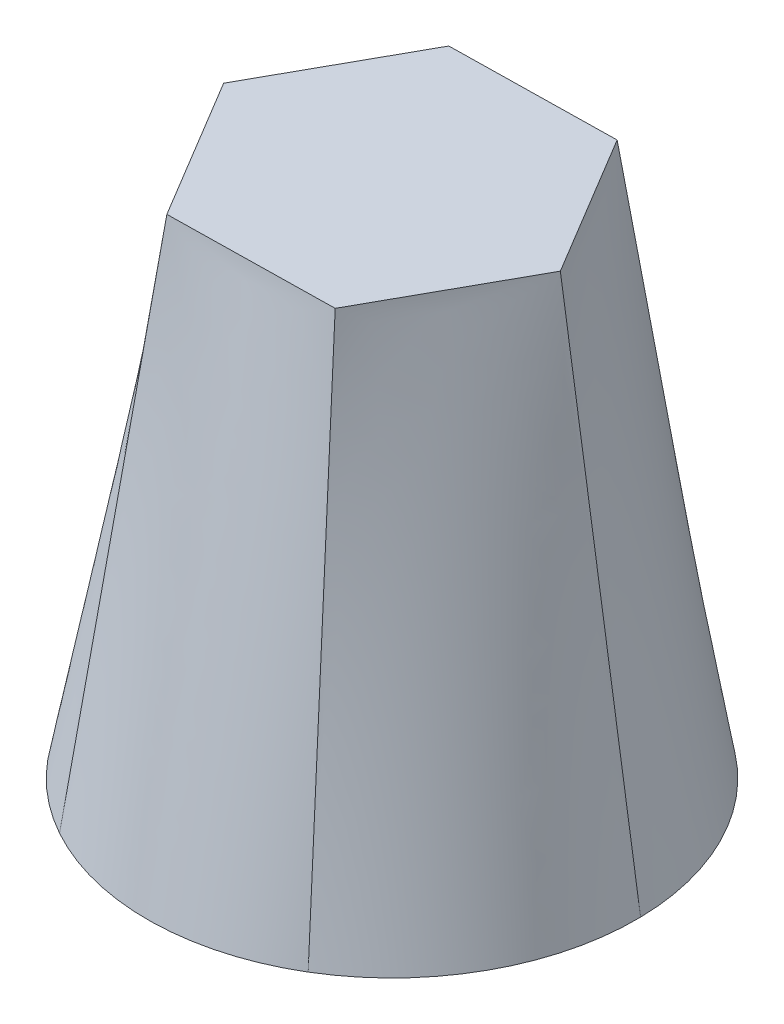
ISO-10303-21;
HEADER;
FILE_DESCRIPTION(('STEP AP214'),'2;1');
FILE_NAME('part.step','',(''),(''),'','','');
FILE_SCHEMA(('AUTOMOTIVE_DESIGN { 1 0 10303 214 1 1 1 1 }'));
ENDSEC;
DATA;
#1=APPLICATION_CONTEXT('core data for automotive mechanical design processes');
#2=APPLICATION_PROTOCOL_DEFINITION('international standard','automotive_design',2000,#1);
#3=PRODUCT_CONTEXT('',#1,'mechanical');
#4=PRODUCT('Part','Part','',(#3));
#5=PRODUCT_RELATED_PRODUCT_CATEGORY('part','',(#4));
#6=PRODUCT_DEFINITION_FORMATION('','',#4);
#7=PRODUCT_DEFINITION_CONTEXT('part definition',#1,'design');
#8=PRODUCT_DEFINITION('design','',#6,#7);
#9=PRODUCT_DEFINITION_SHAPE('','',#8);
#10=(LENGTH_UNIT() NAMED_UNIT(*) SI_UNIT(.MILLI.,.METRE.));
#11=(NAMED_UNIT(*) PLANE_ANGLE_UNIT() SI_UNIT($,.RADIAN.));
#12=(NAMED_UNIT(*) SI_UNIT($,.STERADIAN.) SOLID_ANGLE_UNIT());
#13=UNCERTAINTY_MEASURE_WITH_UNIT(LENGTH_MEASURE(1.E-05),#10,'distance_accuracy_value','');
#14=(GEOMETRIC_REPRESENTATION_CONTEXT(3) GLOBAL_UNCERTAINTY_ASSIGNED_CONTEXT((#13)) GLOBAL_UNIT_ASSIGNED_CONTEXT((#10,
#11,#12)) REPRESENTATION_CONTEXT('',''));
#15=CARTESIAN_POINT('',(0.,0.,0.));
#16=DIRECTION('',(0.,0.,1.));
#17=DIRECTION('',(1.,0.,0.));
#18=AXIS2_PLACEMENT_3D('',#15,#16,#17);
#19=CARTESIAN_POINT('',(0.,0.,0.));
#20=DIRECTION('',(0.,1.,0.));
#21=DIRECTION('',(0.,0.,1.));
#22=AXIS2_PLACEMENT_3D('',#19,#20,#21);
#23=PLANE('',#22);
#24=CARTESIAN_POINT('',(0.,0.,0.));
#25=DIRECTION('',(0.,1.,0.));
#26=DIRECTION('',(0.,0.,1.));
#27=AXIS2_PLACEMENT_3D('',#24,#25,#26);
#28=CIRCLE('',#27,65.740135956893);
#29=CARTESIAN_POINT('',(-65.7308360250275,0.,1.10574458249409));
#30=VERTEX_POINT('',#29);
#31=CARTESIAN_POINT('',(-31.9078151139768,0.,57.4774461009102));
#32=VERTEX_POINT('',#31);
#33=EDGE_CURVE('E12',#30,#32,#28,.T.);
#34=ORIENTED_EDGE('',*,*,#33,.F.);
#35=CARTESIAN_POINT('',(-33.8230209110506,0.,-56.3717015184162));
#36=VERTEX_POINT('',#35);
#37=EDGE_CURVE('E146',#36,#30,#28,.T.);
#38=ORIENTED_EDGE('',*,*,#37,.F.);
#39=CARTESIAN_POINT('',(31.9078151139768,0.,-57.4774461009102));
#40=VERTEX_POINT('',#39);
#41=EDGE_CURVE('E330',#40,#36,#28,.T.);
#42=ORIENTED_EDGE('',*,*,#41,.F.);
#43=CARTESIAN_POINT('',(65.7308360250275,0.,-1.10574458249416));
#44=VERTEX_POINT('',#43);
#45=EDGE_CURVE('E326',#44,#40,#28,.T.);
#46=ORIENTED_EDGE('',*,*,#45,.F.);
#47=CARTESIAN_POINT('',(33.8230209110507,0.,56.3717015184161));
#48=VERTEX_POINT('',#47);
#49=EDGE_CURVE('E247',#48,#44,#28,.T.);
#50=ORIENTED_EDGE('',*,*,#49,.F.);
#51=EDGE_CURVE('E92',#32,#48,#28,.T.);
#52=ORIENTED_EDGE('',*,*,#51,.F.);
#53=EDGE_LOOP('',(#34,#38,#42,#46,#50,#52));
#54=FACE_BOUND('',#53,.T.);
#55=ADVANCED_FACE('F81',(#54),#23,.F.);
#56=CARTESIAN_POINT('',(0.,140.,0.));
#57=DIRECTION('',(0.,1.,0.));
#58=DIRECTION('',(0.,0.,1.));
#59=AXIS2_PLACEMENT_3D('',#56,#57,#58);
#60=PLANE('',#59);
#61=DIRECTION('',(0.999858534946269,0.,-0.0168199314832446));
#62=VECTOR('',#61,1.);
#63=CARTESIAN_POINT('',(-21.6097773689527,140.,38.9269779061924));
#64=LINE('',#63,#62);
#65=CARTESIAN_POINT('',(-21.6097773689527,140.,38.9269779061924));
#66=VERTEX_POINT('',#65);
#67=CARTESIAN_POINT('',(22.9068630748419,140.,38.1781051247353));
#68=VERTEX_POINT('',#67);
#69=EDGE_CURVE('E224',#66,#68,#64,.T.);
#70=ORIENTED_EDGE('',*,*,#69,.T.);
#71=DIRECTION('',(0.485362779518731,0.,-0.874312857195782));
#72=VECTOR('',#71,1.);
#73=CARTESIAN_POINT('',(22.9068630748419,140.,38.1781051247353));
#74=LINE('',#73,#72);
#75=CARTESIAN_POINT('',(44.5166404437946,140.,-0.74887278145714));
#76=VERTEX_POINT('',#75);
#77=EDGE_CURVE('E215',#68,#76,#74,.T.);
#78=ORIENTED_EDGE('',*,*,#77,.T.);
#79=DIRECTION('',(-0.514495755427538,0.,-0.857492925712537));
#80=VECTOR('',#79,1.);
#81=CARTESIAN_POINT('',(44.5166404437946,140.,-0.74887278145714));
#82=LINE('',#81,#80);
#83=CARTESIAN_POINT('',(21.6097773689527,140.,-38.9269779061924));
#84=VERTEX_POINT('',#83);
#85=EDGE_CURVE('E223',#76,#84,#82,.T.);
#86=ORIENTED_EDGE('',*,*,#85,.T.);
#87=DIRECTION('',(-0.999858534946269,0.,0.0168199314832446));
#88=VECTOR('',#87,1.);
#89=CARTESIAN_POINT('',(21.6097773689527,140.,-38.9269779061924));
#90=LINE('',#89,#88);
#91=CARTESIAN_POINT('',(-22.9068630748419,140.,-38.1781051247353));
#92=VERTEX_POINT('',#91);
#93=EDGE_CURVE('E165',#84,#92,#90,.T.);
#94=ORIENTED_EDGE('',*,*,#93,.T.);
#95=DIRECTION('',(-0.485362779518731,0.,0.874312857195782));
#96=VECTOR('',#95,1.);
#97=CARTESIAN_POINT('',(-22.9068630748419,140.,-38.1781051247353));
#98=LINE('',#97,#96);
#99=CARTESIAN_POINT('',(-44.5166404437946,140.,0.748872781457122));
#100=VERTEX_POINT('',#99);
#101=EDGE_CURVE('E143',#92,#100,#98,.T.);
#102=ORIENTED_EDGE('',*,*,#101,.T.);
#103=DIRECTION('',(0.514495755427538,0.,0.857492925712538));
#104=VECTOR('',#103,1.);
#105=CARTESIAN_POINT('',(-44.5166404437946,140.,0.748872781457122));
#106=LINE('',#105,#104);
#107=EDGE_CURVE('E151',#100,#66,#106,.T.);
#108=ORIENTED_EDGE('',*,*,#107,.T.);
#109=EDGE_LOOP('',(#70,#78,#86,#94,#102,#108));
#110=FACE_BOUND('',#109,.T.);
#111=ADVANCED_FACE('F163',(#110),#60,.T.);
#112=CARTESIAN_POINT('',(-44.5166404437946,140.,0.748872781457133));
#113=CARTESIAN_POINT('',(-65.7308360250275,0.,1.10574458249409));
#114=CARTESIAN_POINT('',(-43.6162330534215,140.,-0.87308463130089));
#115=CARTESIAN_POINT('',(-65.7769087159648,0.,-1.63304025188206));
#116=CARTESIAN_POINT('',(-42.7158256630485,140.,-2.49504204405891));
#117=CARTESIAN_POINT('',(-65.6519822431778,0.,-4.42104843356951));
#118=CARTESIAN_POINT('',(-40.9150108823024,140.,-5.73895686957495));
#119=CARTESIAN_POINT('',(-65.0316502511347,0.,-10.0305985526583));
#120=CARTESIAN_POINT('',(-40.0146034919294,140.,-7.36091428233297));
#121=CARTESIAN_POINT('',(-64.5361137708421,0.,-12.8519784839461));
#122=CARTESIAN_POINT('',(-38.2137887111833,140.,-10.604829107849));
#123=CARTESIAN_POINT('',(-63.1626871824775,0.,-18.454221183333));
#124=CARTESIAN_POINT('',(-37.3133813208103,140.,-12.226786520607));
#125=CARTESIAN_POINT('',(-62.2847335134089,0.,-21.2348709548059));
#126=CARTESIAN_POINT('',(-35.5125665400643,140.,-15.4707013461231));
#127=CARTESIAN_POINT('',(-60.1545734397769,0.,-26.6783632852936));
#128=CARTESIAN_POINT('',(-34.6121591496912,140.,-17.0926587588811));
#129=CARTESIAN_POINT('',(-58.9023916495822,0.,-29.3409759030198));
#130=CARTESIAN_POINT('',(-32.8113443689452,140.,-20.3365735843971));
#131=CARTESIAN_POINT('',(-56.0525005522383,0.,-34.4746543249339));
#132=CARTESIAN_POINT('',(-31.9109369785721,140.,-21.9585309971552));
#133=CARTESIAN_POINT('',(-54.4549049918939,0.,-36.9455152302336));
#134=CARTESIAN_POINT('',(-30.1101221978261,140.,-25.2024458226712));
#135=CARTESIAN_POINT('',(-50.9614424711375,0.,-41.6321889235308));
#136=CARTESIAN_POINT('',(-29.2097148074531,140.,-26.8244032354292));
#137=CARTESIAN_POINT('',(-49.0657576487895,0.,-43.8478592173568));
#138=CARTESIAN_POINT('',(-27.408900026707,140.,-30.0683180609452));
#139=CARTESIAN_POINT('',(-45.0373654235432,0.,-47.9762341925784));
#140=CARTESIAN_POINT('',(-26.508492636334,140.,-31.6902754737032));
#141=CARTESIAN_POINT('',(-42.9048724086561,0.,-49.8888801769236));
#142=CARTESIAN_POINT('',(-24.7076778555879,140.,-34.9341902992193));
#143=CARTESIAN_POINT('',(-38.4720072228645,0.,-53.3819548345165));
#144=CARTESIAN_POINT('',(-23.8072704652149,140.,-36.5561477119773));
#145=CARTESIAN_POINT('',(-36.1718418076513,0.,-54.9624089804557));
#146=CARTESIAN_POINT('',(-22.9068630748419,140.,-38.1781051247353));
#147=CARTESIAN_POINT('',(-33.8230209110506,0.,-56.3717015184162));
#148=B_SPLINE_SURFACE_WITH_KNOTS('',3,1,((#112,#113),(#114,#115),(#116,#117),(#118,#119),(#120,
#121),(#122,#123),(#124,#125),(#126,#127),(#128,#129),(#130,#131),(#132,#133),(#134,#135),(#136,
#137),(#138,#139),(#140,#141),(#142,#143),(#144,#145),(#146,#147)),.UNSPECIFIED.,.F.,.F.,.F.,(4,
2,2,2,2,2,2,2,4),(2,2),(0.,0.125,0.25,0.375,0.5,0.625,0.75,0.875,1.),(0.,1.),.UNSPECIFIED.);
#149=DIRECTION('',(-0.0770922609547298,-0.988710194154777,-0.128487101591213));
#150=VECTOR('',#149,1.);
#151=CARTESIAN_POINT('',(-28.3649419929462,70.,-47.2749033215757));
#152=LINE('',#151,#150);
#153=EDGE_CURVE('E150',#92,#36,#152,.T.);
#154=DIRECTION('',(0.149819224513988,0.988710194154777,-0.00252030562636869));
#155=VECTOR('',#154,1.);
#156=CARTESIAN_POINT('',(-55.123738234411,70.,0.927308681975612));
#157=LINE('',#156,#155);
#158=EDGE_CURVE('E138',#30,#100,#157,.T.);
#159=ORIENTED_EDGE('',*,*,#101,.F.);
#160=ORIENTED_EDGE('',*,*,#153,.T.);
#161=ORIENTED_EDGE('',*,*,#37,.T.);
#162=ORIENTED_EDGE('',*,*,#158,.T.);
#163=EDGE_LOOP('',(#159,#160,#161,#162));
#164=FACE_BOUND('',#163,.T.);
#165=ADVANCED_FACE('F140',(#164),#148,.T.);
#166=CARTESIAN_POINT('',(-22.9068630748419,140.,-38.1781051247353));
#167=CARTESIAN_POINT('',(-33.8230209110506,0.,-56.3717015184162));
#168=CARTESIAN_POINT('',(-21.0520030563504,140.,-38.209308157296));
#169=CARTESIAN_POINT('',(-31.47420001445,0.,-57.7809940563766));
#170=CARTESIAN_POINT('',(-19.197143037859,140.,-38.2405111898567));
#171=CARTESIAN_POINT('',(-28.9972508667563,0.,-59.0668086481816));
#172=CARTESIAN_POINT('',(-15.4874230008761,140.,-38.3029172549782));
#173=CARTESIAN_POINT('',(-23.8290719638018,0.,-61.3343604438365));
#174=CARTESIAN_POINT('',(-13.6325629823847,140.,-38.3341202875389));
#175=CARTESIAN_POINT('',(-21.1379170294327,0.,-62.315903229045));
#176=CARTESIAN_POINT('',(-9.92284294540181,140.,-38.3965263526603));
#177=CARTESIAN_POINT('',(-15.5995192394154,0.,-63.9276022629818));
#178=CARTESIAN_POINT('',(-8.06798292691037,140.,-38.427729385221));
#179=CARTESIAN_POINT('',(-12.7524290637582,0.,-64.557596967959));
#180=CARTESIAN_POINT('',(-4.35826288992749,140.,-38.4901354503424));
#181=CARTESIAN_POINT('',(-6.9731463834341,0.,-65.4345703953103));
#182=CARTESIAN_POINT('',(-2.50340287143604,140.,-38.5213384829031));
#183=CARTESIAN_POINT('',(-4.04116532094887,0.,-65.6814554637084));
#184=CARTESIAN_POINT('',(1.20631716554684,140.,-38.5837445480246));
#185=CARTESIAN_POINT('',(1.82967615596068,0.,-65.7802165863466));
#186=CARTESIAN_POINT('',(3.06117718403828,140.,-38.6149475805853));
#187=CARTESIAN_POINT('',(4.76830224934014,0.,-65.632088698765));
#188=CARTESIAN_POINT('',(6.77089722102116,140.,-38.6773536457067));
#189=CARTESIAN_POINT('',(10.573811987362,0.,-64.9499982552697));
#190=CARTESIAN_POINT('',(8.6257572395126,140.,-38.7085566782674));
#191=CARTESIAN_POINT('',(13.4404811593998,0.,-64.4161221884607));
#192=CARTESIAN_POINT('',(12.3354772764955,140.,-38.7709627433888));
#193=CARTESIAN_POINT('',(19.0299548769128,0.,-62.9916196726005));
#194=CARTESIAN_POINT('',(14.1903372949869,140.,-38.8021657759496));
#195=CARTESIAN_POINT('',(21.7526013952456,0.,-62.101149540488));
#196=CARTESIAN_POINT('',(17.9000573319698,140.,-38.864571841071));
#197=CARTESIAN_POINT('',(26.9941253789325,0.,-60.0087130068374));
#198=CARTESIAN_POINT('',(19.7549173504613,140.,-38.8957748736317));
#199=CARTESIAN_POINT('',(29.5129215264389,0.,-58.806938397326));
#200=CARTESIAN_POINT('',(21.6097773689527,140.,-38.9269779061924));
#201=CARTESIAN_POINT('',(31.9078151139768,0.,-57.4774461009102));
#202=B_SPLINE_SURFACE_WITH_KNOTS('',3,1,((#166,#167),(#168,#169),(#170,#171),(#172,#173),(#174,
#175),(#176,#177),(#178,#179),(#180,#181),(#182,#183),(#184,#185),(#186,#187),(#188,#189),(#190,
#191),(#192,#193),(#194,#195),(#196,#197),(#198,#199),(#200,#201)),.UNSPECIFIED.,.F.,.F.,.F.,(4,
2,2,2,2,2,2,2,4),(2,2),(0.,0.125,0.25,0.375,0.5,0.625,0.75,0.875,1.),(0.,1.),.UNSPECIFIED.);
#203=DIRECTION('',(0.0727269635592573,-0.988710194154777,-0.131007407217582));
#204=VECTOR('',#203,1.);
#205=CARTESIAN_POINT('',(26.7587962414648,70.,-48.2022120035513));
#206=LINE('',#205,#204);
#207=EDGE_CURVE('E238',#84,#40,#206,.T.);
#208=ORIENTED_EDGE('',*,*,#93,.F.);
#209=ORIENTED_EDGE('',*,*,#207,.T.);
#210=ORIENTED_EDGE('',*,*,#41,.T.);
#211=ORIENTED_EDGE('',*,*,#153,.F.);
#212=EDGE_LOOP('',(#208,#209,#210,#211));
#213=FACE_BOUND('',#212,.T.);
#214=ADVANCED_FACE('F369',(#213),#202,.T.);
#215=CARTESIAN_POINT('',(-21.6097773689527,140.,38.9269779061924));
#216=CARTESIAN_POINT('',(-31.9078151139768,0.,57.4774461009102));
#217=CARTESIAN_POINT('',(-22.5642299970711,140.,37.3362235259951));
#218=CARTESIAN_POINT('',(-34.3027087015148,0.,56.1479538044945));
#219=CARTESIAN_POINT('',(-23.5186826251895,140.,35.7454691457979));
#220=CARTESIAN_POINT('',(-36.6547313764215,0.,54.6457602146121));
#221=CARTESIAN_POINT('',(-25.4275878814263,140.,32.5639603854033));
#222=CARTESIAN_POINT('',(-41.2025782873328,0.,51.3037618911782));
#223=CARTESIAN_POINT('',(-26.3820405095447,140.,30.973206005206));
#224=CARTESIAN_POINT('',(-43.3981967414093,0.,49.463924745099));
#225=CARTESIAN_POINT('',(-28.2909457657815,140.,27.7916972448114));
#226=CARTESIAN_POINT('',(-47.5631679430621,0.,45.4733810796488));
#227=CARTESIAN_POINT('',(-29.2453983938999,140.,26.2009428646141));
#228=CARTESIAN_POINT('',(-49.5323044496506,0.,43.3227260131532));
#229=CARTESIAN_POINT('',(-31.1543036501367,140.,23.0194341042195));
#230=CARTESIAN_POINT('',(-53.1814270563428,0.,38.7562071100167));
#231=CARTESIAN_POINT('',(-32.1087562782552,140.,21.4286797240222));
#232=CARTESIAN_POINT('',(-54.8612263286333,0.,36.3404795606887));
#233=CARTESIAN_POINT('',(-34.017661534492,140.,18.2471709636276));
#234=CARTESIAN_POINT('',(-57.882176708199,0.,31.3055622614127));
#235=CARTESIAN_POINT('',(-34.9721141626104,140.,16.6564165834303));
#236=CARTESIAN_POINT('',(-59.2232072412341,0.,28.6865734685314));
#237=CARTESIAN_POINT('',(-36.8810194188472,140.,13.4749078230356));
#238=CARTESIAN_POINT('',(-61.5352544584996,0.,23.3178093317389));
#239=CARTESIAN_POINT('',(-37.8354720469656,140.,11.8841534428383));
#240=CARTESIAN_POINT('',(-62.5062388081894,0.,20.568262971104));
#241=CARTESIAN_POINT('',(-39.7443773032025,140.,8.70264468244371));
#242=CARTESIAN_POINT('',(-64.067320300456,0.,15.0153854800222));
#243=CARTESIAN_POINT('',(-40.6988299313209,140.,7.1118903022464));
#244=CARTESIAN_POINT('',(-64.6574738039018,0.,12.2122693635644));
#245=CARTESIAN_POINT('',(-42.6077351875577,140.,3.93038154185176));
#246=CARTESIAN_POINT('',(-65.4661326017971,0.,6.62675817232083));
#247=CARTESIAN_POINT('',(-43.5621878156761,140.,2.33962716165444));
#248=CARTESIAN_POINT('',(-65.6847633340903,0.,3.84452941687024));
#249=CARTESIAN_POINT('',(-44.5166404437946,140.,0.748872781457122));
#250=CARTESIAN_POINT('',(-65.7308360250275,0.,1.10574458249409));
#251=B_SPLINE_SURFACE_WITH_KNOTS('',3,1,((#215,#216),(#217,#218),(#219,#220),(#221,#222),(#223,
#224),(#225,#226),(#227,#228),(#229,#230),(#231,#232),(#233,#234),(#235,#236),(#237,#238),(#239,
#240),(#241,#242),(#243,#244),(#245,#246),(#247,#248),(#249,#250)),.UNSPECIFIED.,.F.,.F.,.F.,(4,
2,2,2,2,2,2,2,4),(2,2),(0.,0.125,0.25,0.375,0.5,0.625,0.75,0.875,1.),(0.,1.),.UNSPECIFIED.);
#252=DIRECTION('',(-0.0727269635592574,-0.988710194154777,0.131007407217582));
#253=VECTOR('',#252,1.);
#254=CARTESIAN_POINT('',(-26.7587962414648,70.,48.2022120035513));
#255=LINE('',#254,#253);
#256=EDGE_CURVE('E100',#66,#32,#255,.T.);
#257=ORIENTED_EDGE('',*,*,#107,.F.);
#258=ORIENTED_EDGE('',*,*,#158,.F.);
#259=ORIENTED_EDGE('',*,*,#33,.T.);
#260=ORIENTED_EDGE('',*,*,#256,.F.);
#261=EDGE_LOOP('',(#257,#258,#259,#260));
#262=FACE_BOUND('',#261,.T.);
#263=ADVANCED_FACE('F154',(#262),#251,.T.);
#264=CARTESIAN_POINT('',(21.6097773689527,140.,-38.9269779061924));
#265=CARTESIAN_POINT('',(31.9078151139768,0.,-57.4774461009102));
#266=CARTESIAN_POINT('',(22.5642299970711,140.,-37.3362235259951));
#267=CARTESIAN_POINT('',(34.3027087015148,0.,-56.1479538044945));
#268=CARTESIAN_POINT('',(23.5186826251895,140.,-35.7454691457978));
#269=CARTESIAN_POINT('',(36.6547313764215,0.,-54.6457602146121));
#270=CARTESIAN_POINT('',(25.4275878814263,140.,-32.5639603854032));
#271=CARTESIAN_POINT('',(41.2025782873328,0.,-51.3037618911782));
#272=CARTESIAN_POINT('',(26.3820405095448,140.,-30.9732060052059));
#273=CARTESIAN_POINT('',(43.3981967414093,0.,-49.463924745099));
#274=CARTESIAN_POINT('',(28.2909457657816,140.,-27.7916972448113));
#275=CARTESIAN_POINT('',(47.5631679430621,0.,-45.4733810796488));
#276=CARTESIAN_POINT('',(29.2453983939,140.,-26.200942864614));
#277=CARTESIAN_POINT('',(49.5323044496506,0.,-43.3227260131532));
#278=CARTESIAN_POINT('',(31.1543036501368,140.,-23.0194341042194));
#279=CARTESIAN_POINT('',(53.1814270563428,0.,-38.7562071100167));
#280=CARTESIAN_POINT('',(32.1087562782552,140.,-21.4286797240221));
#281=CARTESIAN_POINT('',(54.8612263286333,0.,-36.3404795606887));
#282=CARTESIAN_POINT('',(34.017661534492,140.,-18.2471709636275));
#283=CARTESIAN_POINT('',(57.8821767081989,0.,-31.3055622614127));
#284=CARTESIAN_POINT('',(34.9721141626105,140.,-16.6564165834302));
#285=CARTESIAN_POINT('',(59.2232072412341,0.,-28.6865734685315));
#286=CARTESIAN_POINT('',(36.8810194188473,140.,-13.4749078230356));
#287=CARTESIAN_POINT('',(61.5352544584995,0.,-23.3178093317389));
#288=CARTESIAN_POINT('',(37.8354720469657,140.,-11.8841534428383));
#289=CARTESIAN_POINT('',(62.5062388081894,0.,-20.5682629711041));
#290=CARTESIAN_POINT('',(39.7443773032025,140.,-8.70264468244367));
#291=CARTESIAN_POINT('',(64.067320300456,0.,-15.0153854800222));
#292=CARTESIAN_POINT('',(40.6988299313209,140.,-7.11189030224636));
#293=CARTESIAN_POINT('',(64.6574738039018,0.,-12.2122693635645));
#294=CARTESIAN_POINT('',(42.6077351875577,140.,-3.93038154185175));
#295=CARTESIAN_POINT('',(65.4661326017971,0.,-6.62675817232089));
#296=CARTESIAN_POINT('',(43.5621878156762,140.,-2.33962716165445));
#297=CARTESIAN_POINT('',(65.6847633340903,0.,-3.84452941687031));
#298=CARTESIAN_POINT('',(44.5166404437946,140.,-0.74887278145714));
#299=CARTESIAN_POINT('',(65.7308360250275,0.,-1.10574458249416));
#300=B_SPLINE_SURFACE_WITH_KNOTS('',3,1,((#264,#265),(#266,#267),(#268,#269),(#270,#271),(#272,
#273),(#274,#275),(#276,#277),(#278,#279),(#280,#281),(#282,#283),(#284,#285),(#286,#287),(#288,
#289),(#290,#291),(#292,#293),(#294,#295),(#296,#297),(#298,#299)),.UNSPECIFIED.,.F.,.F.,.F.,(4,
2,2,2,2,2,2,2,4),(2,2),(0.,0.125,0.25,0.375,0.5,0.625,0.75,0.875,1.),(0.,1.),.UNSPECIFIED.);
#301=DIRECTION('',(0.149819224513987,-0.988710194154777,-0.00252030562636911));
#302=VECTOR('',#301,1.);
#303=CARTESIAN_POINT('',(55.123738234411,70.,-0.927308681975649));
#304=LINE('',#303,#302);
#305=EDGE_CURVE('E235',#76,#44,#304,.T.);
#306=ORIENTED_EDGE('',*,*,#85,.F.);
#307=ORIENTED_EDGE('',*,*,#305,.T.);
#308=ORIENTED_EDGE('',*,*,#45,.T.);
#309=ORIENTED_EDGE('',*,*,#207,.F.);
#310=EDGE_LOOP('',(#306,#307,#308,#309));
#311=FACE_BOUND('',#310,.T.);
#312=ADVANCED_FACE('F234',(#311),#300,.T.);
#313=CARTESIAN_POINT('',(44.5166404437946,140.,-0.74887278145714));
#314=CARTESIAN_POINT('',(65.7308360250275,0.,-1.10574458249416));
#315=CARTESIAN_POINT('',(43.6162330534215,140.,0.873084631300883));
#316=CARTESIAN_POINT('',(65.7769087159648,0.,1.63304025188199));
#317=CARTESIAN_POINT('',(42.7158256630485,140.,2.49504204405891));
#318=CARTESIAN_POINT('',(65.6519822431778,0.,4.42104843356944));
#319=CARTESIAN_POINT('',(40.9150108823024,140.,5.73895686957495));
#320=CARTESIAN_POINT('',(65.0316502511347,0.,10.0305985526582));
#321=CARTESIAN_POINT('',(40.0146034919294,140.,7.36091428233297));
#322=CARTESIAN_POINT('',(64.5361137708421,0.,12.851978483946));
#323=CARTESIAN_POINT('',(38.2137887111834,140.,10.604829107849));
#324=CARTESIAN_POINT('',(63.1626871824775,0.,18.454221183333));
#325=CARTESIAN_POINT('',(37.3133813208103,140.,12.226786520607));
#326=CARTESIAN_POINT('',(62.2847335134089,0.,21.2348709548058));
#327=CARTESIAN_POINT('',(35.5125665400643,140.,15.4707013461231));
#328=CARTESIAN_POINT('',(60.1545734397769,0.,26.6783632852936));
#329=CARTESIAN_POINT('',(34.6121591496912,140.,17.0926587588811));
#330=CARTESIAN_POINT('',(58.9023916495822,0.,29.3409759030198));
#331=CARTESIAN_POINT('',(32.8113443689452,140.,20.3365735843971));
#332=CARTESIAN_POINT('',(56.0525005522383,0.,34.4746543249339));
#333=CARTESIAN_POINT('',(31.9109369785721,140.,21.9585309971551));
#334=CARTESIAN_POINT('',(54.454904991894,0.,36.9455152302335));
#335=CARTESIAN_POINT('',(30.1101221978261,140.,25.2024458226712));
#336=CARTESIAN_POINT('',(50.9614424711375,0.,41.6321889235308));
#337=CARTESIAN_POINT('',(29.2097148074531,140.,26.8244032354292));
#338=CARTESIAN_POINT('',(49.0657576487896,0.,43.8478592173567));
#339=CARTESIAN_POINT('',(27.408900026707,140.,30.0683180609452));
#340=CARTESIAN_POINT('',(45.0373654235432,0.,47.9762341925783));
#341=CARTESIAN_POINT('',(26.508492636334,140.,31.6902754737032));
#342=CARTESIAN_POINT('',(42.9048724086561,0.,49.8888801769236));
#343=CARTESIAN_POINT('',(24.7076778555879,140.,34.9341902992193));
#344=CARTESIAN_POINT('',(38.4720072228645,0.,53.3819548345165));
#345=CARTESIAN_POINT('',(23.8072704652149,140.,36.5561477119773));
#346=CARTESIAN_POINT('',(36.1718418076514,0.,54.9624089804557));
#347=CARTESIAN_POINT('',(22.9068630748419,140.,38.1781051247353));
#348=CARTESIAN_POINT('',(33.8230209110507,0.,56.3717015184161));
#349=B_SPLINE_SURFACE_WITH_KNOTS('',3,1,((#313,#314),(#315,#316),(#317,#318),(#319,#320),(#321,
#322),(#323,#324),(#325,#326),(#327,#328),(#329,#330),(#331,#332),(#333,#334),(#335,#336),(#337,
#338),(#339,#340),(#341,#342),(#343,#344),(#345,#346),(#347,#348)),.UNSPECIFIED.,.F.,.F.,.F.,(4,
2,2,2,2,2,2,2,4),(2,2),(0.,0.125,0.25,0.375,0.5,0.625,0.75,0.875,1.),(0.,1.),.UNSPECIFIED.);
#350=DIRECTION('',(0.0770922609547301,-0.988710194154777,0.128487101591213));
#351=VECTOR('',#350,1.);
#352=CARTESIAN_POINT('',(28.3649419929463,70.,47.2749033215757));
#353=LINE('',#352,#351);
#354=EDGE_CURVE('E250',#68,#48,#353,.T.);
#355=ORIENTED_EDGE('',*,*,#77,.F.);
#356=ORIENTED_EDGE('',*,*,#354,.T.);
#357=ORIENTED_EDGE('',*,*,#49,.T.);
#358=ORIENTED_EDGE('',*,*,#305,.F.);
#359=EDGE_LOOP('',(#355,#356,#357,#358));
#360=FACE_BOUND('',#359,.T.);
#361=ADVANCED_FACE('F242',(#360),#349,.T.);
#362=CARTESIAN_POINT('',(22.9068630748419,140.,38.1781051247353));
#363=CARTESIAN_POINT('',(33.8230209110507,0.,56.3717015184161));
#364=CARTESIAN_POINT('',(21.0520030563504,140.,38.209308157296));
#365=CARTESIAN_POINT('',(31.47420001445,0.,57.7809940563766));
#366=CARTESIAN_POINT('',(19.197143037859,140.,38.2405111898567));
#367=CARTESIAN_POINT('',(28.9972508667563,0.,59.0668086481816));
#368=CARTESIAN_POINT('',(15.4874230008761,140.,38.3029172549782));
#369=CARTESIAN_POINT('',(23.8290719638019,0.,61.3343604438365));
#370=CARTESIAN_POINT('',(13.6325629823847,140.,38.3341202875389));
#371=CARTESIAN_POINT('',(21.1379170294328,0.,62.315903229045));
#372=CARTESIAN_POINT('',(9.92284294540178,140.,38.3965263526603));
#373=CARTESIAN_POINT('',(15.5995192394155,0.,63.9276022629818));
#374=CARTESIAN_POINT('',(8.06798292691034,140.,38.427729385221));
#375=CARTESIAN_POINT('',(12.7524290637583,0.,64.557596967959));
#376=CARTESIAN_POINT('',(4.35826288992746,140.,38.4901354503424));
#377=CARTESIAN_POINT('',(6.97314638343414,0.,65.4345703953103));
#378=CARTESIAN_POINT('',(2.50340287143603,140.,38.5213384829031));
#379=CARTESIAN_POINT('',(4.0411653209489,0.,65.6814554637085));
#380=CARTESIAN_POINT('',(-1.20631716554686,140.,38.5837445480246));
#381=CARTESIAN_POINT('',(-1.82967615596065,0.,65.7802165863466));
#382=CARTESIAN_POINT('',(-3.0611771840383,140.,38.6149475805853));
#383=CARTESIAN_POINT('',(-4.76830224934012,0.,65.632088698765));
#384=CARTESIAN_POINT('',(-6.77089722102119,140.,38.6773536457067));
#385=CARTESIAN_POINT('',(-10.573811987362,0.,64.9499982552697));
#386=CARTESIAN_POINT('',(-8.62575723951263,140.,38.7085566782674));
#387=CARTESIAN_POINT('',(-13.4404811593998,0.,64.4161221884608));
#388=CARTESIAN_POINT('',(-12.3354772764955,140.,38.7709627433889));
#389=CARTESIAN_POINT('',(-19.0299548769128,0.,62.9916196726005));
#390=CARTESIAN_POINT('',(-14.1903372949869,140.,38.8021657759496));
#391=CARTESIAN_POINT('',(-21.7526013952456,0.,62.101149540488));
#392=CARTESIAN_POINT('',(-17.9000573319698,140.,38.864571841071));
#393=CARTESIAN_POINT('',(-26.9941253789325,0.,60.0087130068374));
#394=CARTESIAN_POINT('',(-19.7549173504613,140.,38.8957748736317));
#395=CARTESIAN_POINT('',(-29.5129215264389,0.,58.806938397326));
#396=CARTESIAN_POINT('',(-21.6097773689527,140.,38.9269779061924));
#397=CARTESIAN_POINT('',(-31.9078151139768,0.,57.4774461009102));
#398=B_SPLINE_SURFACE_WITH_KNOTS('',3,1,((#362,#363),(#364,#365),(#366,#367),(#368,#369),(#370,
#371),(#372,#373),(#374,#375),(#376,#377),(#378,#379),(#380,#381),(#382,#383),(#384,#385),(#386,
#387),(#388,#389),(#390,#391),(#392,#393),(#394,#395),(#396,#397)),.UNSPECIFIED.,.F.,.F.,.F.,(4,
2,2,2,2,2,2,2,4),(2,2),(0.,0.125,0.25,0.375,0.5,0.625,0.75,0.875,1.),(0.,1.),.UNSPECIFIED.);
#399=ORIENTED_EDGE('',*,*,#69,.F.);
#400=ORIENTED_EDGE('',*,*,#256,.T.);
#401=ORIENTED_EDGE('',*,*,#51,.T.);
#402=ORIENTED_EDGE('',*,*,#354,.F.);
#403=EDGE_LOOP('',(#399,#400,#401,#402));
#404=FACE_BOUND('',#403,.T.);
#405=ADVANCED_FACE('F275',(#404),#398,.T.);
#406=CLOSED_SHELL('',(#55,#111,#165,#214,#263,#312,#361,#405));
#407=MANIFOLD_SOLID_BREP('B2',#406);
#408=ADVANCED_BREP_SHAPE_REPRESENTATION('',(#18,#407),#14);
#409=SHAPE_DEFINITION_REPRESENTATION(#9,#408);
ENDSEC;
END-ISO-10303-21;
